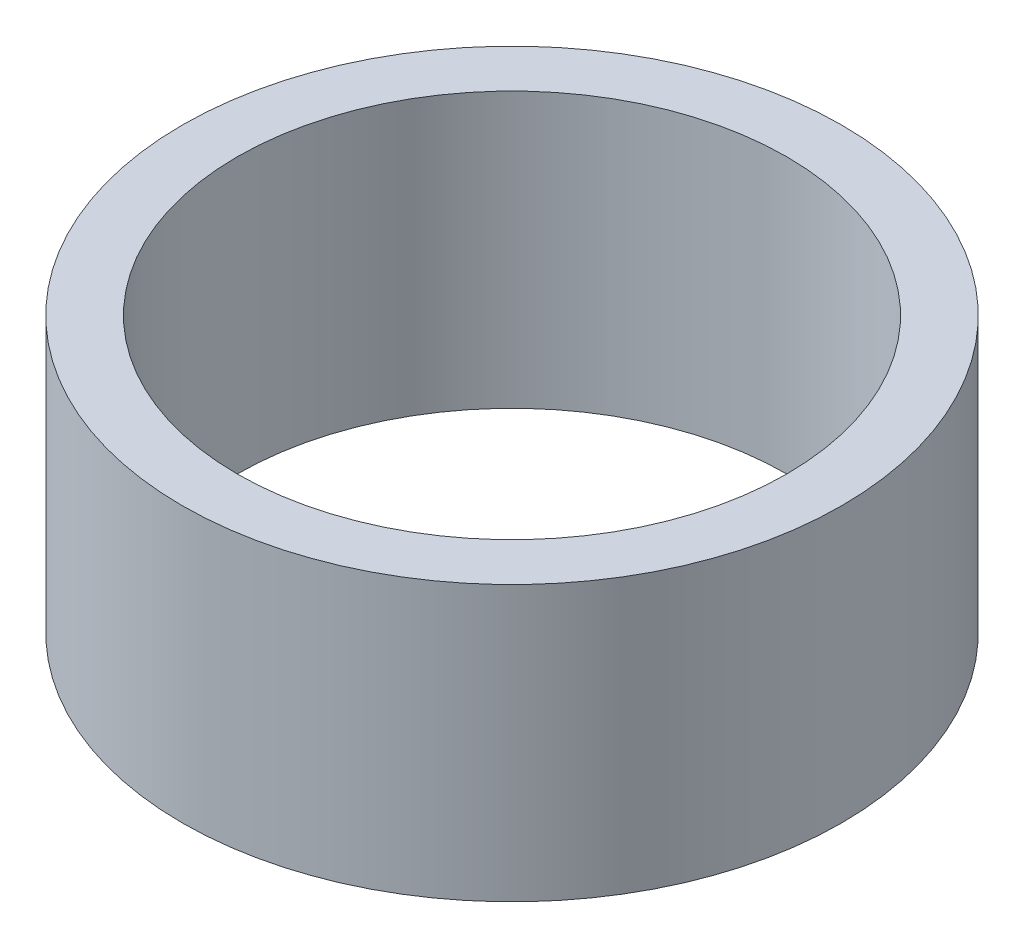
ISO-10303-21;
HEADER;
FILE_DESCRIPTION(('STEP AP214'),'2;1');
FILE_NAME('part.step','',(''),(''),'','','');
FILE_SCHEMA(('AUTOMOTIVE_DESIGN { 1 0 10303 214 1 1 1 1 }'));
ENDSEC;
DATA;
#1=APPLICATION_CONTEXT('core data for automotive mechanical design processes');
#2=APPLICATION_PROTOCOL_DEFINITION('international standard','automotive_design',2000,#1);
#3=PRODUCT_CONTEXT('',#1,'mechanical');
#4=PRODUCT('Part','Part','',(#3));
#5=PRODUCT_RELATED_PRODUCT_CATEGORY('part','',(#4));
#6=PRODUCT_DEFINITION_FORMATION('','',#4);
#7=PRODUCT_DEFINITION_CONTEXT('part definition',#1,'design');
#8=PRODUCT_DEFINITION('design','',#6,#7);
#9=PRODUCT_DEFINITION_SHAPE('','',#8);
#10=(LENGTH_UNIT() NAMED_UNIT(*) SI_UNIT(.MILLI.,.METRE.));
#11=(NAMED_UNIT(*) PLANE_ANGLE_UNIT() SI_UNIT($,.RADIAN.));
#12=(NAMED_UNIT(*) SI_UNIT($,.STERADIAN.) SOLID_ANGLE_UNIT());
#13=UNCERTAINTY_MEASURE_WITH_UNIT(LENGTH_MEASURE(1.E-05),#10,'distance_accuracy_value','');
#14=(GEOMETRIC_REPRESENTATION_CONTEXT(3) GLOBAL_UNCERTAINTY_ASSIGNED_CONTEXT((#13)) GLOBAL_UNIT_ASSIGNED_CONTEXT((#10,
#11,#12)) REPRESENTATION_CONTEXT('',''));
#15=CARTESIAN_POINT('',(0.,0.,0.));
#16=DIRECTION('',(0.,0.,1.));
#17=DIRECTION('',(1.,0.,0.));
#18=AXIS2_PLACEMENT_3D('',#15,#16,#17);
#19=CARTESIAN_POINT('',(0.,25.,0.));
#20=DIRECTION('',(0.,1.,0.));
#21=DIRECTION('',(0.,0.,1.));
#22=AXIS2_PLACEMENT_3D('',#19,#20,#21);
#23=PLANE('',#22);
#24=CARTESIAN_POINT('',(0.,25.,0.));
#25=DIRECTION('',(0.,1.,0.));
#26=DIRECTION('',(0.,0.,1.));
#27=AXIS2_PLACEMENT_3D('',#24,#25,#26);
#28=CIRCLE('',#27,30.);
#29=CARTESIAN_POINT('',(0.,25.,30.));
#30=VERTEX_POINT('',#29);
#31=EDGE_CURVE('E10',#30,#30,#28,.T.);
#32=ORIENTED_EDGE('',*,*,#31,.T.);
#33=EDGE_LOOP('',(#32));
#34=FACE_BOUND('',#33,.T.);
#35=CARTESIAN_POINT('',(0.,25.,0.));
#36=DIRECTION('',(0.,1.,0.));
#37=DIRECTION('',(0.,0.,1.));
#38=AXIS2_PLACEMENT_3D('',#35,#36,#37);
#39=CIRCLE('',#38,25.);
#40=CARTESIAN_POINT('',(0.,25.,25.));
#41=VERTEX_POINT('',#40);
#42=EDGE_CURVE('E50',#41,#41,#39,.T.);
#43=ORIENTED_EDGE('',*,*,#42,.F.);
#44=EDGE_LOOP('',(#43));
#45=FACE_BOUND('',#44,.T.);
#46=ADVANCED_FACE('F37',(#34,#45),#23,.T.);
#47=CARTESIAN_POINT('',(0.,0.,0.));
#48=DIRECTION('',(0.,1.,0.));
#49=DIRECTION('',(0.,0.,1.));
#50=AXIS2_PLACEMENT_3D('',#47,#48,#49);
#51=PLANE('',#50);
#52=CARTESIAN_POINT('',(0.,0.,0.));
#53=DIRECTION('',(0.,1.,0.));
#54=DIRECTION('',(0.,0.,1.));
#55=AXIS2_PLACEMENT_3D('',#52,#53,#54);
#56=CIRCLE('',#55,30.);
#57=CARTESIAN_POINT('',(0.,0.,30.));
#58=VERTEX_POINT('',#57);
#59=EDGE_CURVE('E41',#58,#58,#56,.T.);
#60=ORIENTED_EDGE('',*,*,#59,.F.);
#61=EDGE_LOOP('',(#60));
#62=FACE_BOUND('',#61,.T.);
#63=CARTESIAN_POINT('',(0.,0.,0.));
#64=DIRECTION('',(0.,1.,0.));
#65=DIRECTION('',(0.,0.,1.));
#66=AXIS2_PLACEMENT_3D('',#63,#64,#65);
#67=CIRCLE('',#66,25.);
#68=CARTESIAN_POINT('',(0.,0.,25.));
#69=VERTEX_POINT('',#68);
#70=EDGE_CURVE('E52',#69,#69,#67,.T.);
#71=ORIENTED_EDGE('',*,*,#70,.T.);
#72=EDGE_LOOP('',(#71));
#73=FACE_BOUND('',#72,.T.);
#74=ADVANCED_FACE('F64',(#62,#73),#51,.F.);
#75=CARTESIAN_POINT('',(0.,25.,0.));
#76=DIRECTION('',(0.,-1.,0.));
#77=DIRECTION('',(0.,0.,-1.));
#78=AXIS2_PLACEMENT_3D('',#75,#76,#77);
#79=CYLINDRICAL_SURFACE('',#78,30.);
#80=ORIENTED_EDGE('',*,*,#31,.F.);
#81=EDGE_LOOP('',(#80));
#82=FACE_BOUND('',#81,.T.);
#83=ORIENTED_EDGE('',*,*,#59,.T.);
#84=EDGE_LOOP('',(#83));
#85=FACE_BOUND('',#84,.T.);
#86=ADVANCED_FACE('F39',(#82,#85),#79,.T.);
#87=CARTESIAN_POINT('',(0.,25.,0.));
#88=DIRECTION('',(0.,-1.,0.));
#89=DIRECTION('',(0.,0.,-1.));
#90=AXIS2_PLACEMENT_3D('',#87,#88,#89);
#91=CYLINDRICAL_SURFACE('',#90,25.);
#92=ORIENTED_EDGE('',*,*,#42,.T.);
#93=EDGE_LOOP('',(#92));
#94=FACE_BOUND('',#93,.T.);
#95=ORIENTED_EDGE('',*,*,#70,.F.);
#96=EDGE_LOOP('',(#95));
#97=FACE_BOUND('',#96,.T.);
#98=ADVANCED_FACE('F60',(#94,#97),#91,.F.);
#99=CLOSED_SHELL('',(#46,#74,#86,#98));
#100=MANIFOLD_SOLID_BREP('B2',#99);
#101=ADVANCED_BREP_SHAPE_REPRESENTATION('',(#18,#100),#14);
#102=SHAPE_DEFINITION_REPRESENTATION(#9,#101);
ENDSEC;
END-ISO-10303-21;
